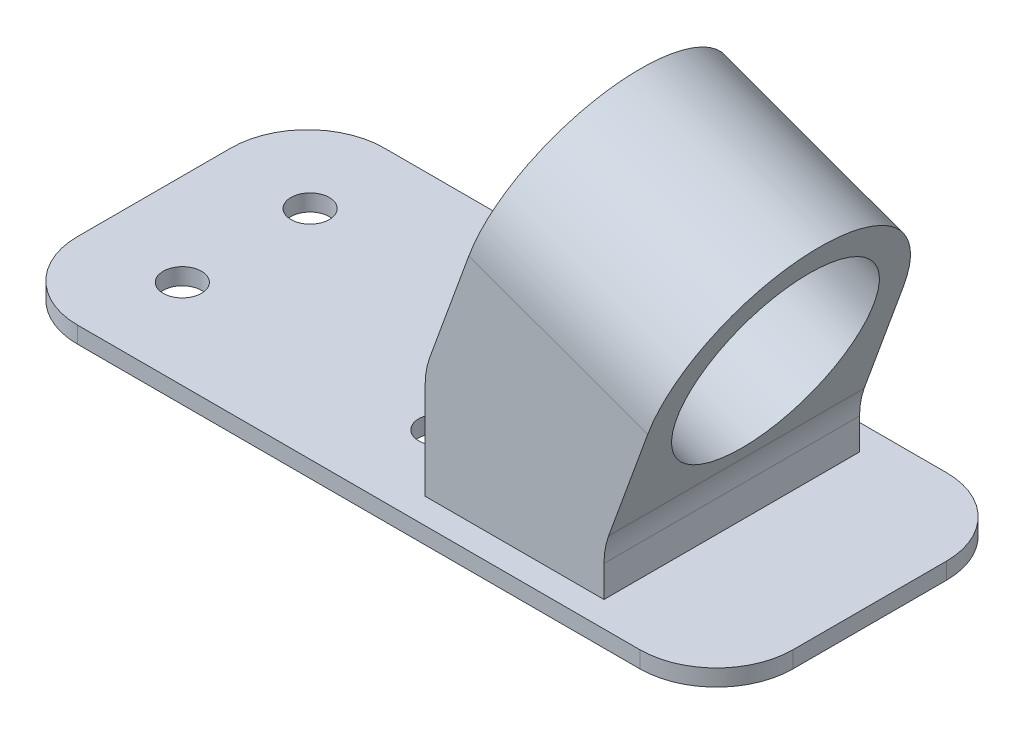
ISO-10303-21;
HEADER;
FILE_DESCRIPTION(('STEP AP214'),'2;1');
FILE_NAME('part.step','',(''),(''),'','','');
FILE_SCHEMA(('AUTOMOTIVE_DESIGN { 1 0 10303 214 1 1 1 1 }'));
ENDSEC;
DATA;
#1=APPLICATION_CONTEXT('core data for automotive mechanical design processes');
#2=APPLICATION_PROTOCOL_DEFINITION('international standard','automotive_design',2000,#1);
#3=PRODUCT_CONTEXT('',#1,'mechanical');
#4=PRODUCT('Part','Part','',(#3));
#5=PRODUCT_RELATED_PRODUCT_CATEGORY('part','',(#4));
#6=PRODUCT_DEFINITION_FORMATION('','',#4);
#7=PRODUCT_DEFINITION_CONTEXT('part definition',#1,'design');
#8=PRODUCT_DEFINITION('design','',#6,#7);
#9=PRODUCT_DEFINITION_SHAPE('','',#8);
#10=(LENGTH_UNIT() NAMED_UNIT(*) SI_UNIT(.MILLI.,.METRE.));
#11=(NAMED_UNIT(*) PLANE_ANGLE_UNIT() SI_UNIT($,.RADIAN.));
#12=(NAMED_UNIT(*) SI_UNIT($,.STERADIAN.) SOLID_ANGLE_UNIT());
#13=UNCERTAINTY_MEASURE_WITH_UNIT(LENGTH_MEASURE(1.E-05),#10,'distance_accuracy_value','');
#14=(GEOMETRIC_REPRESENTATION_CONTEXT(3) GLOBAL_UNCERTAINTY_ASSIGNED_CONTEXT((#13)) GLOBAL_UNIT_ASSIGNED_CONTEXT((#10,
#11,#12)) REPRESENTATION_CONTEXT('',''));
#15=CARTESIAN_POINT('',(0.,0.,0.));
#16=DIRECTION('',(0.,0.,1.));
#17=DIRECTION('',(1.,0.,0.));
#18=AXIS2_PLACEMENT_3D('',#15,#16,#17);
#19=CARTESIAN_POINT('',(5.02020143325663,14.3447178477225,-5.));
#20=DIRECTION('',(0.93969262078591,-0.342020143325663,0.));
#21=DIRECTION('',(0.342020143325663,0.939692620785911,0.));
#22=AXIS2_PLACEMENT_3D('',#19,#20,#21);
#23=PLANE('',#22);
#24=DIRECTION('',(-0.342020143325663,-0.93969262078591,0.));
#25=VECTOR('',#24,1.);
#26=CARTESIAN_POINT('',(5.02020143325663,14.3447178477225,-5.));
#27=LINE('',#26,#25);
#28=CARTESIAN_POINT('',(3.31010071662832,9.64625474379292,-5.));
#29=VERTEX_POINT('',#28);
#30=CARTESIAN_POINT('',(1.78092213764227,5.44487112771497,-5.));
#31=VERTEX_POINT('',#30);
#32=EDGE_CURVE('E198',#29,#31,#27,.T.);
#33=ORIENTED_EDGE('',*,*,#32,.T.);
#34=DIRECTION('',(0.,0.,1.));
#35=VECTOR('',#34,1.);
#36=CARTESIAN_POINT('',(1.78092213764227,5.44487112771497,5.));
#37=LINE('',#36,#35);
#38=CARTESIAN_POINT('',(1.78092213764227,5.44487112771497,5.));
#39=VERTEX_POINT('',#38);
#40=EDGE_CURVE('E300',#31,#39,#37,.T.);
#41=ORIENTED_EDGE('',*,*,#40,.T.);
#42=DIRECTION('',(-0.342020143325663,-0.93969262078591,0.));
#43=VECTOR('',#42,1.);
#44=CARTESIAN_POINT('',(5.02020143325663,14.3447178477225,5.));
#45=LINE('',#44,#43);
#46=CARTESIAN_POINT('',(3.31010071662832,9.64625474379292,5.));
#47=VERTEX_POINT('',#46);
#48=EDGE_CURVE('E211',#47,#39,#45,.T.);
#49=ORIENTED_EDGE('',*,*,#48,.F.);
#50=CARTESIAN_POINT('',(3.31010071662832,9.64625474379293,0.));
#51=DIRECTION('',(-0.939692620785911,0.342020143325663,0.));
#52=DIRECTION('',(-0.342020143325663,-0.93969262078591,0.));
#53=AXIS2_PLACEMENT_3D('',#50,#51,#52);
#54=CIRCLE('',#53,5.);
#55=EDGE_CURVE('E205',#29,#47,#54,.F.);
#56=ORIENTED_EDGE('',*,*,#55,.F.);
#57=EDGE_LOOP('',(#33,#41,#49,#56));
#58=FACE_BOUND('',#57,.T.);
#59=CARTESIAN_POINT('',(3.31010071662832,9.64625474379293,0.));
#60=DIRECTION('',(-0.939692620785911,0.342020143325663,0.));
#61=DIRECTION('',(-0.342020143325663,-0.939692620785911,0.));
#62=AXIS2_PLACEMENT_3D('',#59,#60,#61);
#63=CIRCLE('',#62,3.85);
#64=CARTESIAN_POINT('',(1.99332316482452,6.02843815376717,0.));
#65=VERTEX_POINT('',#64);
#66=EDGE_CURVE('E207',#65,#65,#63,.T.);
#67=ORIENTED_EDGE('',*,*,#66,.F.);
#68=EDGE_LOOP('',(#67));
#69=FACE_BOUND('',#68,.T.);
#70=ADVANCED_FACE('F75',(#58,#69),#23,.F.);
#71=CARTESIAN_POINT('',(12.0202014332566,11.7969262078591,-5.));
#72=DIRECTION('',(-0.93969262078591,0.342020143325663,0.));
#73=DIRECTION('',(-0.342020143325663,-0.939692620785911,0.));
#74=AXIS2_PLACEMENT_3D('',#71,#72,#73);
#75=PLANE('',#74);
#76=DIRECTION('',(-0.342020143325663,-0.93969262078591,0.));
#77=VECTOR('',#76,1.);
#78=CARTESIAN_POINT('',(12.0202014332566,11.7969262078591,5.));
#79=LINE('',#78,#77);
#80=CARTESIAN_POINT('',(10.3101007166283,7.09846310392955,5.));
#81=VERTEX_POINT('',#80);
#82=CARTESIAN_POINT('',(8.78092213764227,2.8970794878516,5.));
#83=VERTEX_POINT('',#82);
#84=EDGE_CURVE('E192',#81,#83,#79,.T.);
#85=ORIENTED_EDGE('',*,*,#84,.T.);
#86=DIRECTION('',(0.,0.,1.));
#87=VECTOR('',#86,1.);
#88=CARTESIAN_POINT('',(8.78092213764227,2.89707948785161,-5.));
#89=LINE('',#88,#87);
#90=CARTESIAN_POINT('',(8.78092213764227,2.8970794878516,-5.));
#91=VERTEX_POINT('',#90);
#92=EDGE_CURVE('E298',#83,#91,#89,.F.);
#93=ORIENTED_EDGE('',*,*,#92,.T.);
#94=DIRECTION('',(-0.342020143325663,-0.93969262078591,0.));
#95=VECTOR('',#94,1.);
#96=CARTESIAN_POINT('',(12.0202014332566,11.7969262078591,-5.));
#97=LINE('',#96,#95);
#98=CARTESIAN_POINT('',(10.3101007166283,7.09846310392956,-5.));
#99=VERTEX_POINT('',#98);
#100=EDGE_CURVE('E195',#99,#91,#97,.T.);
#101=ORIENTED_EDGE('',*,*,#100,.F.);
#102=CARTESIAN_POINT('',(10.3101007166283,7.09846310392956,0.));
#103=DIRECTION('',(-0.93969262078591,0.342020143325663,0.));
#104=DIRECTION('',(-0.342020143325663,-0.939692620785911,0.));
#105=AXIS2_PLACEMENT_3D('',#102,#103,#104);
#106=CIRCLE('',#105,5.);
#107=EDGE_CURVE('E187',#81,#99,#106,.T.);
#108=ORIENTED_EDGE('',*,*,#107,.F.);
#109=EDGE_LOOP('',(#85,#93,#101,#108));
#110=FACE_BOUND('',#109,.T.);
#111=CARTESIAN_POINT('',(10.3101007166283,7.09846310392956,0.));
#112=DIRECTION('',(-0.93969262078591,0.342020143325663,0.));
#113=DIRECTION('',(-0.342020143325663,-0.939692620785911,0.));
#114=AXIS2_PLACEMENT_3D('',#111,#112,#113);
#115=CIRCLE('',#114,3.85);
#116=CARTESIAN_POINT('',(8.99332316482452,3.4806465139038,0.));
#117=VERTEX_POINT('',#116);
#118=EDGE_CURVE('E420',#117,#117,#115,.F.);
#119=ORIENTED_EDGE('',*,*,#118,.F.);
#120=EDGE_LOOP('',(#119));
#121=FACE_BOUND('',#120,.T.);
#122=ADVANCED_FACE('F189',(#110,#121),#75,.F.);
#123=CARTESIAN_POINT('',(0.,0.,5.));
#124=DIRECTION('',(0.,0.,-1.));
#125=DIRECTION('',(-1.,0.,0.));
#126=AXIS2_PLACEMENT_3D('',#123,#124,#125);
#127=PLANE('',#126);
#128=ORIENTED_EDGE('',*,*,#48,.T.);
#129=CARTESIAN_POINT('',(4.6,4.41881069773798,5.));
#130=DIRECTION('',(0.,0.,-1.));
#131=DIRECTION('',(-1.,0.,0.));
#132=AXIS2_PLACEMENT_3D('',#129,#130,#131);
#133=CIRCLE('',#132,3.);
#134=CARTESIAN_POINT('',(1.6,4.41881069773798,5.));
#135=VERTEX_POINT('',#134);
#136=EDGE_CURVE('E98',#39,#135,#133,.F.);
#137=ORIENTED_EDGE('',*,*,#136,.T.);
#138=DIRECTION('',(0.,-1.,0.));
#139=VECTOR('',#138,1.);
#140=CARTESIAN_POINT('',(1.6,0.65,5.));
#141=LINE('',#140,#139);
#142=CARTESIAN_POINT('',(1.6,0.65,5.));
#143=VERTEX_POINT('',#142);
#144=EDGE_CURVE('E222',#135,#143,#141,.T.);
#145=ORIENTED_EDGE('',*,*,#144,.T.);
#146=DIRECTION('',(1.,0.,0.));
#147=VECTOR('',#146,1.);
#148=CARTESIAN_POINT('',(8.6,0.65,5.));
#149=LINE('',#148,#147);
#150=CARTESIAN_POINT('',(8.6,0.65,5.));
#151=VERTEX_POINT('',#150);
#152=EDGE_CURVE('E213',#143,#151,#149,.T.);
#153=ORIENTED_EDGE('',*,*,#152,.T.);
#154=DIRECTION('',(0.,1.,0.));
#155=VECTOR('',#154,1.);
#156=CARTESIAN_POINT('',(8.6,2.4,5.));
#157=LINE('',#156,#155);
#158=CARTESIAN_POINT('',(8.6,1.87101905787461,5.));
#159=VERTEX_POINT('',#158);
#160=EDGE_CURVE('E229',#151,#159,#157,.T.);
#161=ORIENTED_EDGE('',*,*,#160,.T.);
#162=CARTESIAN_POINT('',(11.6,1.87101905787461,5.));
#163=DIRECTION('',(0.,0.,-1.));
#164=DIRECTION('',(-1.,0.,0.));
#165=AXIS2_PLACEMENT_3D('',#162,#163,#164);
#166=CIRCLE('',#165,3.);
#167=EDGE_CURVE('E83',#159,#83,#166,.T.);
#168=ORIENTED_EDGE('',*,*,#167,.T.);
#169=ORIENTED_EDGE('',*,*,#84,.F.);
#170=DIRECTION('',(-0.939692620785911,0.342020143325663,0.));
#171=VECTOR('',#170,1.);
#172=CARTESIAN_POINT('',(15.8509702606998,5.08175151793542,5.));
#173=LINE('',#172,#171);
#174=EDGE_CURVE('E202',#81,#47,#173,.T.);
#175=ORIENTED_EDGE('',*,*,#174,.T.);
#176=EDGE_LOOP('',(#128,#137,#145,#153,#161,#168,#169,#175));
#177=FACE_BOUND('',#176,.T.);
#178=ADVANCED_FACE('F209',(#177),#127,.F.);
#179=CARTESIAN_POINT('',(0.,0.,-5.));
#180=DIRECTION('',(0.,0.,-1.));
#181=DIRECTION('',(-1.,0.,0.));
#182=AXIS2_PLACEMENT_3D('',#179,#180,#181);
#183=PLANE('',#182);
#184=DIRECTION('',(0.,-1.,0.));
#185=VECTOR('',#184,1.);
#186=CARTESIAN_POINT('',(1.6,0.65,-5.));
#187=LINE('',#186,#185);
#188=CARTESIAN_POINT('',(1.6,4.41881069773798,-5.));
#189=VERTEX_POINT('',#188);
#190=CARTESIAN_POINT('',(1.6,0.65,-5.));
#191=VERTEX_POINT('',#190);
#192=EDGE_CURVE('E225',#189,#191,#187,.T.);
#193=ORIENTED_EDGE('',*,*,#192,.F.);
#194=CARTESIAN_POINT('',(4.6,4.41881069773798,-5.));
#195=DIRECTION('',(0.,0.,-1.));
#196=DIRECTION('',(-1.,0.,0.));
#197=AXIS2_PLACEMENT_3D('',#194,#195,#196);
#198=CIRCLE('',#197,3.);
#199=EDGE_CURVE('E305',#189,#31,#198,.T.);
#200=ORIENTED_EDGE('',*,*,#199,.T.);
#201=ORIENTED_EDGE('',*,*,#32,.F.);
#202=DIRECTION('',(-0.939692620785911,0.342020143325663,0.));
#203=VECTOR('',#202,1.);
#204=CARTESIAN_POINT('',(15.8509702606998,5.08175151793542,-5.));
#205=LINE('',#204,#203);
#206=EDGE_CURVE('E199',#99,#29,#205,.T.);
#207=ORIENTED_EDGE('',*,*,#206,.F.);
#208=ORIENTED_EDGE('',*,*,#100,.T.);
#209=CARTESIAN_POINT('',(11.6,1.87101905787461,-5.));
#210=DIRECTION('',(0.,0.,-1.));
#211=DIRECTION('',(-1.,0.,0.));
#212=AXIS2_PLACEMENT_3D('',#209,#210,#211);
#213=CIRCLE('',#212,3.);
#214=CARTESIAN_POINT('',(8.6,1.87101905787461,-5.));
#215=VERTEX_POINT('',#214);
#216=EDGE_CURVE('E12',#91,#215,#213,.F.);
#217=ORIENTED_EDGE('',*,*,#216,.T.);
#218=DIRECTION('',(0.,1.,0.));
#219=VECTOR('',#218,1.);
#220=CARTESIAN_POINT('',(8.6,2.4,-5.));
#221=LINE('',#220,#219);
#222=CARTESIAN_POINT('',(8.6,0.65,-5.));
#223=VERTEX_POINT('',#222);
#224=EDGE_CURVE('E221',#223,#215,#221,.T.);
#225=ORIENTED_EDGE('',*,*,#224,.F.);
#226=DIRECTION('',(1.,0.,0.));
#227=VECTOR('',#226,1.);
#228=CARTESIAN_POINT('',(8.6,0.65,-5.));
#229=LINE('',#228,#227);
#230=EDGE_CURVE('E218',#191,#223,#229,.T.);
#231=ORIENTED_EDGE('',*,*,#230,.F.);
#232=EDGE_LOOP('',(#193,#200,#201,#207,#208,#217,#225,#231));
#233=FACE_BOUND('',#232,.T.);
#234=ADVANCED_FACE('F310',(#233),#183,.T.);
#235=CARTESIAN_POINT('',(11.,0.65,-3.));
#236=DIRECTION('',(0.,-1.,0.));
#237=DIRECTION('',(0.,0.,-1.));
#238=AXIS2_PLACEMENT_3D('',#235,#236,#237);
#239=PLANE('',#238);
#240=CARTESIAN_POINT('',(-10.4,0.65,2.5));
#241=DIRECTION('',(0.,1.,0.));
#242=DIRECTION('',(0.,0.,1.));
#243=AXIS2_PLACEMENT_3D('',#240,#241,#242);
#244=CIRCLE('',#243,0.75);
#245=CARTESIAN_POINT('',(-10.4,0.65,3.25));
#246=VERTEX_POINT('',#245);
#247=EDGE_CURVE('E433',#246,#246,#244,.T.);
#248=ORIENTED_EDGE('',*,*,#247,.F.);
#249=EDGE_LOOP('',(#248));
#250=FACE_BOUND('',#249,.T.);
#251=CARTESIAN_POINT('',(-0.399999999999997,0.65,2.5));
#252=DIRECTION('',(0.,1.,0.));
#253=DIRECTION('',(0.,0.,1.));
#254=AXIS2_PLACEMENT_3D('',#251,#252,#253);
#255=CIRCLE('',#254,0.75);
#256=CARTESIAN_POINT('',(-0.399999999999997,0.65,3.25));
#257=VERTEX_POINT('',#256);
#258=EDGE_CURVE('E439',#257,#257,#255,.T.);
#259=ORIENTED_EDGE('',*,*,#258,.F.);
#260=EDGE_LOOP('',(#259));
#261=FACE_BOUND('',#260,.T.);
#262=CARTESIAN_POINT('',(-0.399999999999997,0.65,-2.5));
#263=DIRECTION('',(0.,1.,0.));
#264=DIRECTION('',(0.,0.,1.));
#265=AXIS2_PLACEMENT_3D('',#262,#263,#264);
#266=CIRCLE('',#265,0.75);
#267=CARTESIAN_POINT('',(-0.399999999999997,0.65,-1.75));
#268=VERTEX_POINT('',#267);
#269=EDGE_CURVE('E427',#268,#268,#266,.T.);
#270=ORIENTED_EDGE('',*,*,#269,.F.);
#271=EDGE_LOOP('',(#270));
#272=FACE_BOUND('',#271,.T.);
#273=CARTESIAN_POINT('',(-10.4,0.65,-2.5));
#274=DIRECTION('',(0.,1.,0.));
#275=DIRECTION('',(0.,0.,1.));
#276=AXIS2_PLACEMENT_3D('',#273,#274,#275);
#277=CIRCLE('',#276,0.75);
#278=CARTESIAN_POINT('',(-10.4,0.65,-1.75));
#279=VERTEX_POINT('',#278);
#280=EDGE_CURVE('E423',#279,#279,#277,.T.);
#281=ORIENTED_EDGE('',*,*,#280,.F.);
#282=EDGE_LOOP('',(#281));
#283=FACE_BOUND('',#282,.T.);
#284=CARTESIAN_POINT('',(11.,0.65,-3.));
#285=DIRECTION('',(0.,1.,0.));
#286=DIRECTION('',(0.,0.,-1.));
#287=AXIS2_PLACEMENT_3D('',#284,#285,#286);
#288=CIRCLE('',#287,3.);
#289=CARTESIAN_POINT('',(14.,0.65,-2.99999999999998));
#290=VERTEX_POINT('',#289);
#291=CARTESIAN_POINT('',(11.,0.65,-6.));
#292=VERTEX_POINT('',#291);
#293=EDGE_CURVE('E238',#290,#292,#288,.T.);
#294=ORIENTED_EDGE('',*,*,#293,.T.);
#295=DIRECTION('',(-1.,0.,0.));
#296=VECTOR('',#295,1.);
#297=CARTESIAN_POINT('',(-11.,0.65,-6.));
#298=LINE('',#297,#296);
#299=CARTESIAN_POINT('',(-11.,0.65,-6.));
#300=VERTEX_POINT('',#299);
#301=EDGE_CURVE('E241',#292,#300,#298,.T.);
#302=ORIENTED_EDGE('',*,*,#301,.T.);
#303=CARTESIAN_POINT('',(-11.,0.65,-3.));
#304=DIRECTION('',(0.,1.,0.));
#305=DIRECTION('',(0.,0.,-1.));
#306=AXIS2_PLACEMENT_3D('',#303,#304,#305);
#307=CIRCLE('',#306,3.);
#308=CARTESIAN_POINT('',(-14.,0.65,-2.99999999999998));
#309=VERTEX_POINT('',#308);
#310=EDGE_CURVE('E244',#300,#309,#307,.T.);
#311=ORIENTED_EDGE('',*,*,#310,.T.);
#312=DIRECTION('',(0.,0.,1.));
#313=VECTOR('',#312,1.);
#314=CARTESIAN_POINT('',(-14.,0.65,2.99999999999998));
#315=LINE('',#314,#313);
#316=CARTESIAN_POINT('',(-14.,0.65,2.99999999999998));
#317=VERTEX_POINT('',#316);
#318=EDGE_CURVE('E246',#309,#317,#315,.T.);
#319=ORIENTED_EDGE('',*,*,#318,.T.);
#320=CARTESIAN_POINT('',(-11.,0.65,3.));
#321=DIRECTION('',(0.,1.,0.));
#322=DIRECTION('',(0.,0.,-1.));
#323=AXIS2_PLACEMENT_3D('',#320,#321,#322);
#324=CIRCLE('',#323,3.);
#325=CARTESIAN_POINT('',(-11.,0.65,6.));
#326=VERTEX_POINT('',#325);
#327=EDGE_CURVE('E248',#317,#326,#324,.T.);
#328=ORIENTED_EDGE('',*,*,#327,.T.);
#329=DIRECTION('',(1.,0.,0.));
#330=VECTOR('',#329,1.);
#331=CARTESIAN_POINT('',(-11.,0.65,6.));
#332=LINE('',#331,#330);
#333=CARTESIAN_POINT('',(11.,0.65,6.));
#334=VERTEX_POINT('',#333);
#335=EDGE_CURVE('E250',#326,#334,#332,.T.);
#336=ORIENTED_EDGE('',*,*,#335,.T.);
#337=CARTESIAN_POINT('',(11.,0.65,3.));
#338=DIRECTION('',(0.,1.,0.));
#339=DIRECTION('',(0.,0.,-1.));
#340=AXIS2_PLACEMENT_3D('',#337,#338,#339);
#341=CIRCLE('',#340,3.);
#342=CARTESIAN_POINT('',(14.,0.65,2.99999999999998));
#343=VERTEX_POINT('',#342);
#344=EDGE_CURVE('E252',#334,#343,#341,.T.);
#345=ORIENTED_EDGE('',*,*,#344,.T.);
#346=DIRECTION('',(0.,0.,-1.));
#347=VECTOR('',#346,1.);
#348=CARTESIAN_POINT('',(14.,0.65,2.99999999999998));
#349=LINE('',#348,#347);
#350=EDGE_CURVE('E254',#343,#290,#349,.T.);
#351=ORIENTED_EDGE('',*,*,#350,.T.);
#352=EDGE_LOOP('',(#294,#302,#311,#319,#328,#336,#345,#351));
#353=FACE_BOUND('',#352,.T.);
#354=ORIENTED_EDGE('',*,*,#152,.F.);
#355=DIRECTION('',(0.,0.,1.));
#356=VECTOR('',#355,1.);
#357=CARTESIAN_POINT('',(1.6,0.65,-5.));
#358=LINE('',#357,#356);
#359=EDGE_CURVE('E232',#191,#143,#358,.T.);
#360=ORIENTED_EDGE('',*,*,#359,.F.);
#361=ORIENTED_EDGE('',*,*,#230,.T.);
#362=DIRECTION('',(0.,0.,1.));
#363=VECTOR('',#362,1.);
#364=CARTESIAN_POINT('',(8.6,0.65,-5.));
#365=LINE('',#364,#363);
#366=EDGE_CURVE('E227',#223,#151,#365,.T.);
#367=ORIENTED_EDGE('',*,*,#366,.T.);
#368=EDGE_LOOP('',(#354,#360,#361,#367));
#369=FACE_BOUND('',#368,.T.);
#370=ADVANCED_FACE('F334',(#250,#261,#272,#283,#353,#369),#239,.F.);
#371=CARTESIAN_POINT('',(11.,0.65,-3.));
#372=DIRECTION('',(0.,-1.,0.));
#373=DIRECTION('',(0.,0.,-1.));
#374=AXIS2_PLACEMENT_3D('',#371,#372,#373);
#375=CYLINDRICAL_SURFACE('',#374,3.);
#376=CARTESIAN_POINT('',(11.,0.,-3.));
#377=DIRECTION('',(0.,1.,0.));
#378=DIRECTION('',(0.,0.,-1.));
#379=AXIS2_PLACEMENT_3D('',#376,#377,#378);
#380=CIRCLE('',#379,3.);
#381=CARTESIAN_POINT('',(14.,0.,-2.99999999999998));
#382=VERTEX_POINT('',#381);
#383=CARTESIAN_POINT('',(11.,0.,-6.));
#384=VERTEX_POINT('',#383);
#385=EDGE_CURVE('E235',#382,#384,#380,.T.);
#386=ORIENTED_EDGE('',*,*,#385,.T.);
#387=DIRECTION('',(0.,-1.,0.));
#388=VECTOR('',#387,1.);
#389=CARTESIAN_POINT('',(11.,0.65,-6.));
#390=LINE('',#389,#388);
#391=EDGE_CURVE('E292',#292,#384,#390,.T.);
#392=ORIENTED_EDGE('',*,*,#391,.F.);
#393=ORIENTED_EDGE('',*,*,#293,.F.);
#394=DIRECTION('',(0.,-1.,0.));
#395=VECTOR('',#394,1.);
#396=CARTESIAN_POINT('',(14.,0.65,-2.99999999999998));
#397=LINE('',#396,#395);
#398=EDGE_CURVE('E256',#290,#382,#397,.T.);
#399=ORIENTED_EDGE('',*,*,#398,.T.);
#400=EDGE_LOOP('',(#386,#392,#393,#399));
#401=FACE_BOUND('',#400,.T.);
#402=ADVANCED_FACE('F347',(#401),#375,.T.);
#403=CARTESIAN_POINT('',(-11.,0.65,-6.));
#404=DIRECTION('',(0.,0.,1.));
#405=DIRECTION('',(1.,0.,0.));
#406=AXIS2_PLACEMENT_3D('',#403,#404,#405);
#407=PLANE('',#406);
#408=DIRECTION('',(-1.,0.,0.));
#409=VECTOR('',#408,1.);
#410=CARTESIAN_POINT('',(-11.,0.,-6.));
#411=LINE('',#410,#409);
#412=CARTESIAN_POINT('',(-11.,0.,-6.));
#413=VERTEX_POINT('',#412);
#414=EDGE_CURVE('E259',#384,#413,#411,.T.);
#415=ORIENTED_EDGE('',*,*,#414,.T.);
#416=DIRECTION('',(0.,-1.,0.));
#417=VECTOR('',#416,1.);
#418=CARTESIAN_POINT('',(-11.,0.65,-6.));
#419=LINE('',#418,#417);
#420=EDGE_CURVE('E289',#300,#413,#419,.T.);
#421=ORIENTED_EDGE('',*,*,#420,.F.);
#422=ORIENTED_EDGE('',*,*,#301,.F.);
#423=ORIENTED_EDGE('',*,*,#391,.T.);
#424=EDGE_LOOP('',(#415,#421,#422,#423));
#425=FACE_BOUND('',#424,.T.);
#426=ADVANCED_FACE('F375',(#425),#407,.F.);
#427=CARTESIAN_POINT('',(-11.,0.65,-3.));
#428=DIRECTION('',(0.,-1.,0.));
#429=DIRECTION('',(0.,0.,-1.));
#430=AXIS2_PLACEMENT_3D('',#427,#428,#429);
#431=CYLINDRICAL_SURFACE('',#430,3.);
#432=CARTESIAN_POINT('',(-11.,0.,-3.));
#433=DIRECTION('',(0.,1.,0.));
#434=DIRECTION('',(0.,0.,-1.));
#435=AXIS2_PLACEMENT_3D('',#432,#433,#434);
#436=CIRCLE('',#435,3.);
#437=CARTESIAN_POINT('',(-14.,0.,-2.99999999999998));
#438=VERTEX_POINT('',#437);
#439=EDGE_CURVE('E261',#413,#438,#436,.T.);
#440=ORIENTED_EDGE('',*,*,#439,.T.);
#441=DIRECTION('',(0.,-1.,0.));
#442=VECTOR('',#441,1.);
#443=CARTESIAN_POINT('',(-14.,0.65,-2.99999999999998));
#444=LINE('',#443,#442);
#445=EDGE_CURVE('E286',#309,#438,#444,.T.);
#446=ORIENTED_EDGE('',*,*,#445,.F.);
#447=ORIENTED_EDGE('',*,*,#310,.F.);
#448=ORIENTED_EDGE('',*,*,#420,.T.);
#449=EDGE_LOOP('',(#440,#446,#447,#448));
#450=FACE_BOUND('',#449,.T.);
#451=ADVANCED_FACE('F371',(#450),#431,.T.);
#452=CARTESIAN_POINT('',(-14.,0.65,2.99999999999998));
#453=DIRECTION('',(1.,0.,0.));
#454=DIRECTION('',(0.,0.,-1.));
#455=AXIS2_PLACEMENT_3D('',#452,#453,#454);
#456=PLANE('',#455);
#457=DIRECTION('',(0.,0.,1.));
#458=VECTOR('',#457,1.);
#459=CARTESIAN_POINT('',(-14.,0.,2.99999999999998));
#460=LINE('',#459,#458);
#461=CARTESIAN_POINT('',(-14.,0.,2.99999999999998));
#462=VERTEX_POINT('',#461);
#463=EDGE_CURVE('E263',#438,#462,#460,.T.);
#464=ORIENTED_EDGE('',*,*,#463,.T.);
#465=DIRECTION('',(0.,-1.,0.));
#466=VECTOR('',#465,1.);
#467=CARTESIAN_POINT('',(-14.,0.65,2.99999999999998));
#468=LINE('',#467,#466);
#469=EDGE_CURVE('E283',#317,#462,#468,.T.);
#470=ORIENTED_EDGE('',*,*,#469,.F.);
#471=ORIENTED_EDGE('',*,*,#318,.F.);
#472=ORIENTED_EDGE('',*,*,#445,.T.);
#473=EDGE_LOOP('',(#464,#470,#471,#472));
#474=FACE_BOUND('',#473,.T.);
#475=ADVANCED_FACE('F367',(#474),#456,.F.);
#476=CARTESIAN_POINT('',(-11.,0.65,3.));
#477=DIRECTION('',(0.,-1.,0.));
#478=DIRECTION('',(0.,0.,-1.));
#479=AXIS2_PLACEMENT_3D('',#476,#477,#478);
#480=CYLINDRICAL_SURFACE('',#479,3.);
#481=CARTESIAN_POINT('',(-11.,0.,3.));
#482=DIRECTION('',(0.,1.,0.));
#483=DIRECTION('',(0.,0.,-1.));
#484=AXIS2_PLACEMENT_3D('',#481,#482,#483);
#485=CIRCLE('',#484,3.);
#486=CARTESIAN_POINT('',(-11.,0.,6.));
#487=VERTEX_POINT('',#486);
#488=EDGE_CURVE('E265',#462,#487,#485,.T.);
#489=ORIENTED_EDGE('',*,*,#488,.T.);
#490=DIRECTION('',(0.,-1.,0.));
#491=VECTOR('',#490,1.);
#492=CARTESIAN_POINT('',(-11.,0.65,6.));
#493=LINE('',#492,#491);
#494=EDGE_CURVE('E280',#326,#487,#493,.T.);
#495=ORIENTED_EDGE('',*,*,#494,.F.);
#496=ORIENTED_EDGE('',*,*,#327,.F.);
#497=ORIENTED_EDGE('',*,*,#469,.T.);
#498=EDGE_LOOP('',(#489,#495,#496,#497));
#499=FACE_BOUND('',#498,.T.);
#500=ADVANCED_FACE('F363',(#499),#480,.T.);
#501=CARTESIAN_POINT('',(-11.,0.65,6.));
#502=DIRECTION('',(0.,0.,-1.));
#503=DIRECTION('',(-1.,0.,0.));
#504=AXIS2_PLACEMENT_3D('',#501,#502,#503);
#505=PLANE('',#504);
#506=DIRECTION('',(1.,0.,0.));
#507=VECTOR('',#506,1.);
#508=CARTESIAN_POINT('',(-11.,0.,6.));
#509=LINE('',#508,#507);
#510=CARTESIAN_POINT('',(11.,0.,6.));
#511=VERTEX_POINT('',#510);
#512=EDGE_CURVE('E267',#487,#511,#509,.T.);
#513=ORIENTED_EDGE('',*,*,#512,.T.);
#514=DIRECTION('',(0.,-1.,0.));
#515=VECTOR('',#514,1.);
#516=CARTESIAN_POINT('',(11.,0.65,6.));
#517=LINE('',#516,#515);
#518=EDGE_CURVE('E277',#334,#511,#517,.T.);
#519=ORIENTED_EDGE('',*,*,#518,.F.);
#520=ORIENTED_EDGE('',*,*,#335,.F.);
#521=ORIENTED_EDGE('',*,*,#494,.T.);
#522=EDGE_LOOP('',(#513,#519,#520,#521));
#523=FACE_BOUND('',#522,.T.);
#524=ADVANCED_FACE('F359',(#523),#505,.F.);
#525=CARTESIAN_POINT('',(11.,0.65,3.));
#526=DIRECTION('',(0.,-1.,0.));
#527=DIRECTION('',(0.,0.,-1.));
#528=AXIS2_PLACEMENT_3D('',#525,#526,#527);
#529=CYLINDRICAL_SURFACE('',#528,3.);
#530=CARTESIAN_POINT('',(11.,0.,3.));
#531=DIRECTION('',(0.,1.,0.));
#532=DIRECTION('',(0.,0.,-1.));
#533=AXIS2_PLACEMENT_3D('',#530,#531,#532);
#534=CIRCLE('',#533,3.);
#535=CARTESIAN_POINT('',(14.,0.,2.99999999999998));
#536=VERTEX_POINT('',#535);
#537=EDGE_CURVE('E269',#511,#536,#534,.T.);
#538=ORIENTED_EDGE('',*,*,#537,.T.);
#539=DIRECTION('',(0.,-1.,0.));
#540=VECTOR('',#539,1.);
#541=CARTESIAN_POINT('',(14.,0.65,2.99999999999998));
#542=LINE('',#541,#540);
#543=EDGE_CURVE('E274',#343,#536,#542,.T.);
#544=ORIENTED_EDGE('',*,*,#543,.F.);
#545=ORIENTED_EDGE('',*,*,#344,.F.);
#546=ORIENTED_EDGE('',*,*,#518,.T.);
#547=EDGE_LOOP('',(#538,#544,#545,#546));
#548=FACE_BOUND('',#547,.T.);
#549=ADVANCED_FACE('F355',(#548),#529,.T.);
#550=CARTESIAN_POINT('',(14.,0.65,2.99999999999998));
#551=DIRECTION('',(-1.,0.,0.));
#552=DIRECTION('',(0.,0.,1.));
#553=AXIS2_PLACEMENT_3D('',#550,#551,#552);
#554=PLANE('',#553);
#555=DIRECTION('',(0.,0.,-1.));
#556=VECTOR('',#555,1.);
#557=CARTESIAN_POINT('',(14.,0.,2.99999999999998));
#558=LINE('',#557,#556);
#559=EDGE_CURVE('E242',#536,#382,#558,.T.);
#560=ORIENTED_EDGE('',*,*,#559,.T.);
#561=ORIENTED_EDGE('',*,*,#398,.F.);
#562=ORIENTED_EDGE('',*,*,#350,.F.);
#563=ORIENTED_EDGE('',*,*,#543,.T.);
#564=EDGE_LOOP('',(#560,#561,#562,#563));
#565=FACE_BOUND('',#564,.T.);
#566=ADVANCED_FACE('F351',(#565),#554,.F.);
#567=CARTESIAN_POINT('',(11.,0.,-3.));
#568=DIRECTION('',(0.,-1.,0.));
#569=DIRECTION('',(0.,0.,-1.));
#570=AXIS2_PLACEMENT_3D('',#567,#568,#569);
#571=PLANE('',#570);
#572=CARTESIAN_POINT('',(-10.4,0.,2.5));
#573=DIRECTION('',(0.,-1.,0.));
#574=DIRECTION('',(0.,0.,-1.));
#575=AXIS2_PLACEMENT_3D('',#572,#573,#574);
#576=CIRCLE('',#575,0.75);
#577=CARTESIAN_POINT('',(-10.4,0.,1.75));
#578=VERTEX_POINT('',#577);
#579=EDGE_CURVE('E430',#578,#578,#576,.F.);
#580=ORIENTED_EDGE('',*,*,#579,.T.);
#581=EDGE_LOOP('',(#580));
#582=FACE_BOUND('',#581,.T.);
#583=CARTESIAN_POINT('',(-0.399999999999997,0.,2.5));
#584=DIRECTION('',(0.,-1.,0.));
#585=DIRECTION('',(0.,0.,-1.));
#586=AXIS2_PLACEMENT_3D('',#583,#584,#585);
#587=CIRCLE('',#586,0.75);
#588=CARTESIAN_POINT('',(-0.399999999999997,0.,1.75));
#589=VERTEX_POINT('',#588);
#590=EDGE_CURVE('E436',#589,#589,#587,.F.);
#591=ORIENTED_EDGE('',*,*,#590,.T.);
#592=EDGE_LOOP('',(#591));
#593=FACE_BOUND('',#592,.T.);
#594=CARTESIAN_POINT('',(-0.399999999999997,0.,-2.5));
#595=DIRECTION('',(0.,-1.,0.));
#596=DIRECTION('',(0.,0.,-1.));
#597=AXIS2_PLACEMENT_3D('',#594,#595,#596);
#598=CIRCLE('',#597,0.75);
#599=CARTESIAN_POINT('',(-0.399999999999997,0.,-3.25));
#600=VERTEX_POINT('',#599);
#601=EDGE_CURVE('E442',#600,#600,#598,.F.);
#602=ORIENTED_EDGE('',*,*,#601,.T.);
#603=EDGE_LOOP('',(#602));
#604=FACE_BOUND('',#603,.T.);
#605=CARTESIAN_POINT('',(-10.4,0.,-2.5));
#606=DIRECTION('',(0.,-1.,0.));
#607=DIRECTION('',(0.,0.,-1.));
#608=AXIS2_PLACEMENT_3D('',#605,#606,#607);
#609=CIRCLE('',#608,0.75);
#610=CARTESIAN_POINT('',(-10.4,0.,-3.25));
#611=VERTEX_POINT('',#610);
#612=EDGE_CURVE('E424',#611,#611,#609,.F.);
#613=ORIENTED_EDGE('',*,*,#612,.T.);
#614=EDGE_LOOP('',(#613));
#615=FACE_BOUND('',#614,.T.);
#616=ORIENTED_EDGE('',*,*,#385,.F.);
#617=ORIENTED_EDGE('',*,*,#559,.F.);
#618=ORIENTED_EDGE('',*,*,#537,.F.);
#619=ORIENTED_EDGE('',*,*,#512,.F.);
#620=ORIENTED_EDGE('',*,*,#488,.F.);
#621=ORIENTED_EDGE('',*,*,#463,.F.);
#622=ORIENTED_EDGE('',*,*,#439,.F.);
#623=ORIENTED_EDGE('',*,*,#414,.F.);
#624=EDGE_LOOP('',(#616,#617,#618,#619,#620,#621,#622,#623));
#625=FACE_BOUND('',#624,.T.);
#626=ADVANCED_FACE('F341',(#582,#593,#604,#615,#625),#571,.T.);
#627=CARTESIAN_POINT('',(1.6,0.65,-5.));
#628=DIRECTION('',(-1.,0.,0.));
#629=DIRECTION('',(0.,0.,1.));
#630=AXIS2_PLACEMENT_3D('',#627,#628,#629);
#631=PLANE('',#630);
#632=ORIENTED_EDGE('',*,*,#144,.F.);
#633=DIRECTION('',(0.,0.,1.));
#634=VECTOR('',#633,1.);
#635=CARTESIAN_POINT('',(1.6,4.41881069773798,-5.));
#636=LINE('',#635,#634);
#637=EDGE_CURVE('E90',#135,#189,#636,.F.);
#638=ORIENTED_EDGE('',*,*,#637,.T.);
#639=ORIENTED_EDGE('',*,*,#192,.T.);
#640=ORIENTED_EDGE('',*,*,#359,.T.);
#641=EDGE_LOOP('',(#632,#638,#639,#640));
#642=FACE_BOUND('',#641,.T.);
#643=ADVANCED_FACE('F337',(#642),#631,.T.);
#644=CARTESIAN_POINT('',(8.6,2.4,-5.));
#645=DIRECTION('',(1.,0.,0.));
#646=DIRECTION('',(0.,0.,-1.));
#647=AXIS2_PLACEMENT_3D('',#644,#645,#646);
#648=PLANE('',#647);
#649=ORIENTED_EDGE('',*,*,#224,.T.);
#650=DIRECTION('',(0.,0.,1.));
#651=VECTOR('',#650,1.);
#652=CARTESIAN_POINT('',(8.6,1.87101905787461,-5.));
#653=LINE('',#652,#651);
#654=EDGE_CURVE('E295',#215,#159,#653,.T.);
#655=ORIENTED_EDGE('',*,*,#654,.T.);
#656=ORIENTED_EDGE('',*,*,#160,.F.);
#657=ORIENTED_EDGE('',*,*,#366,.F.);
#658=EDGE_LOOP('',(#649,#655,#656,#657));
#659=FACE_BOUND('',#658,.T.);
#660=ADVANCED_FACE('F340',(#659),#648,.T.);
#661=CARTESIAN_POINT('',(15.8509702606998,5.08175151793543,0.));
#662=DIRECTION('',(-0.939692620785911,0.342020143325663,0.));
#663=DIRECTION('',(-0.342020143325663,-0.939692620785911,0.));
#664=AXIS2_PLACEMENT_3D('',#661,#662,#663);
#665=CYLINDRICAL_SURFACE('',#664,5.);
#666=ORIENTED_EDGE('',*,*,#107,.T.);
#667=ORIENTED_EDGE('',*,*,#206,.T.);
#668=ORIENTED_EDGE('',*,*,#55,.T.);
#669=ORIENTED_EDGE('',*,*,#174,.F.);
#670=EDGE_LOOP('',(#666,#667,#668,#669));
#671=FACE_BOUND('',#670,.T.);
#672=ADVANCED_FACE('F203',(#671),#665,.T.);
#673=CARTESIAN_POINT('',(15.8509702606998,5.08175151793543,0.));
#674=DIRECTION('',(-0.939692620785911,0.342020143325663,0.));
#675=DIRECTION('',(-0.342020143325663,-0.939692620785911,0.));
#676=AXIS2_PLACEMENT_3D('',#673,#674,#675);
#677=CYLINDRICAL_SURFACE('',#676,3.85);
#678=ORIENTED_EDGE('',*,*,#66,.T.);
#679=EDGE_LOOP('',(#678));
#680=FACE_BOUND('',#679,.T.);
#681=ORIENTED_EDGE('',*,*,#118,.T.);
#682=EDGE_LOOP('',(#681));
#683=FACE_BOUND('',#682,.T.);
#684=ADVANCED_FACE('F455',(#680,#683),#677,.F.);
#685=CARTESIAN_POINT('',(-10.4,-0.00100000000000002,-2.5));
#686=DIRECTION('',(0.,1.,0.));
#687=DIRECTION('',(0.,0.,1.));
#688=AXIS2_PLACEMENT_3D('',#685,#686,#687);
#689=CYLINDRICAL_SURFACE('',#688,0.75);
#690=ORIENTED_EDGE('',*,*,#612,.F.);
#691=EDGE_LOOP('',(#690));
#692=FACE_BOUND('',#691,.T.);
#693=ORIENTED_EDGE('',*,*,#280,.T.);
#694=EDGE_LOOP('',(#693));
#695=FACE_BOUND('',#694,.T.);
#696=ADVANCED_FACE('F453',(#692,#695),#689,.F.);
#697=CARTESIAN_POINT('',(-0.399999999999997,-0.00100000000000002,-2.5));
#698=DIRECTION('',(0.,1.,0.));
#699=DIRECTION('',(0.,0.,1.));
#700=AXIS2_PLACEMENT_3D('',#697,#698,#699);
#701=CYLINDRICAL_SURFACE('',#700,0.75);
#702=ORIENTED_EDGE('',*,*,#601,.F.);
#703=EDGE_LOOP('',(#702));
#704=FACE_BOUND('',#703,.T.);
#705=ORIENTED_EDGE('',*,*,#269,.T.);
#706=EDGE_LOOP('',(#705));
#707=FACE_BOUND('',#706,.T.);
#708=ADVANCED_FACE('F448',(#704,#707),#701,.F.);
#709=CARTESIAN_POINT('',(-0.399999999999997,-0.00100000000000002,2.5));
#710=DIRECTION('',(0.,1.,0.));
#711=DIRECTION('',(0.,0.,1.));
#712=AXIS2_PLACEMENT_3D('',#709,#710,#711);
#713=CYLINDRICAL_SURFACE('',#712,0.75);
#714=ORIENTED_EDGE('',*,*,#590,.F.);
#715=EDGE_LOOP('',(#714));
#716=FACE_BOUND('',#715,.T.);
#717=ORIENTED_EDGE('',*,*,#258,.T.);
#718=EDGE_LOOP('',(#717));
#719=FACE_BOUND('',#718,.T.);
#720=ADVANCED_FACE('F462',(#716,#719),#713,.F.);
#721=CARTESIAN_POINT('',(-10.4,-0.00100000000000002,2.5));
#722=DIRECTION('',(0.,1.,0.));
#723=DIRECTION('',(0.,0.,1.));
#724=AXIS2_PLACEMENT_3D('',#721,#722,#723);
#725=CYLINDRICAL_SURFACE('',#724,0.75);
#726=ORIENTED_EDGE('',*,*,#579,.F.);
#727=EDGE_LOOP('',(#726));
#728=FACE_BOUND('',#727,.T.);
#729=ORIENTED_EDGE('',*,*,#247,.T.);
#730=EDGE_LOOP('',(#729));
#731=FACE_BOUND('',#730,.T.);
#732=ADVANCED_FACE('F321',(#728,#731),#725,.F.);
#733=CARTESIAN_POINT('',(11.6,1.87101905787461,-5.));
#734=DIRECTION('',(0.,0.,1.));
#735=DIRECTION('',(1.,0.,0.));
#736=AXIS2_PLACEMENT_3D('',#733,#734,#735);
#737=CYLINDRICAL_SURFACE('',#736,3.);
#738=ORIENTED_EDGE('',*,*,#216,.F.);
#739=ORIENTED_EDGE('',*,*,#92,.F.);
#740=ORIENTED_EDGE('',*,*,#167,.F.);
#741=ORIENTED_EDGE('',*,*,#654,.F.);
#742=EDGE_LOOP('',(#738,#739,#740,#741));
#743=FACE_BOUND('',#742,.T.);
#744=ADVANCED_FACE('F317',(#743),#737,.F.);
#745=CARTESIAN_POINT('',(4.6,4.41881069773798,-5.));
#746=DIRECTION('',(0.,0.,-1.));
#747=DIRECTION('',(-1.,0.,0.));
#748=AXIS2_PLACEMENT_3D('',#745,#746,#747);
#749=CYLINDRICAL_SURFACE('',#748,3.);
#750=ORIENTED_EDGE('',*,*,#199,.F.);
#751=ORIENTED_EDGE('',*,*,#637,.F.);
#752=ORIENTED_EDGE('',*,*,#136,.F.);
#753=ORIENTED_EDGE('',*,*,#40,.F.);
#754=EDGE_LOOP('',(#750,#751,#752,#753));
#755=FACE_BOUND('',#754,.T.);
#756=ADVANCED_FACE('F77',(#755),#749,.T.);
#757=CLOSED_SHELL('',(#70,#122,#178,#234,#370,#402,#426,#451,#475,#500,#524,#549,#566,#626,#643,
#660,#672,#684,#696,#708,#720,#732,#744,#756));
#758=MANIFOLD_SOLID_BREP('B2',#757);
#759=ADVANCED_BREP_SHAPE_REPRESENTATION('',(#18,#758),#14);
#760=SHAPE_DEFINITION_REPRESENTATION(#9,#759);
ENDSEC;
END-ISO-10303-21;
